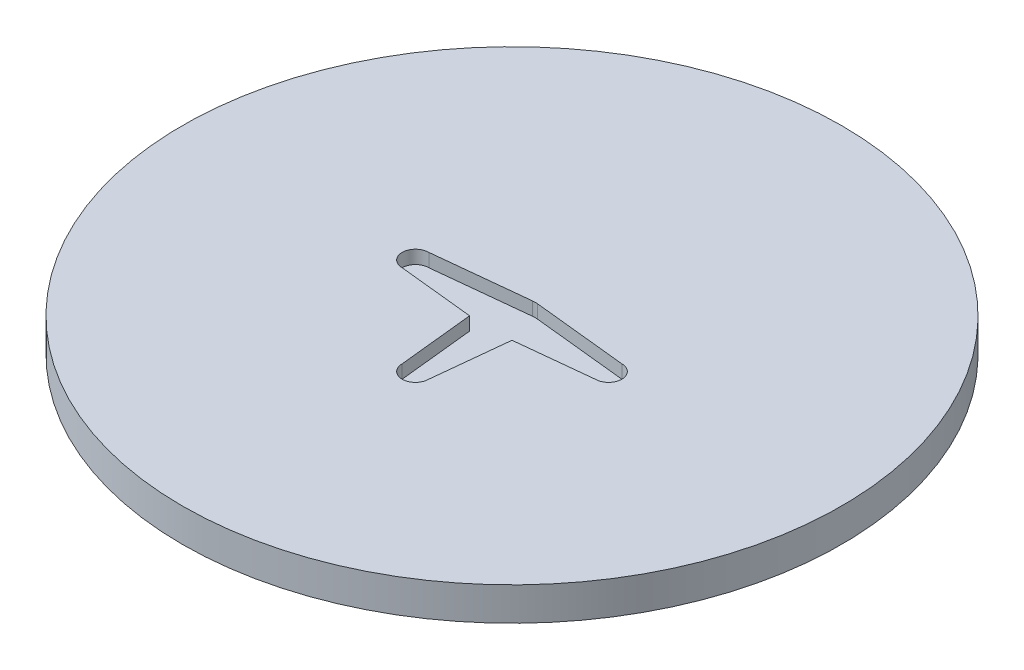
ISO-10303-21;
HEADER;
FILE_DESCRIPTION(('STEP AP214'),'2;1');
FILE_NAME('part.step','',(''),(''),'','','');
FILE_SCHEMA(('AUTOMOTIVE_DESIGN { 1 0 10303 214 1 1 1 1 }'));
ENDSEC;
DATA;
#1=APPLICATION_CONTEXT('core data for automotive mechanical design processes');
#2=APPLICATION_PROTOCOL_DEFINITION('international standard','automotive_design',2000,#1);
#3=PRODUCT_CONTEXT('',#1,'mechanical');
#4=PRODUCT('Part','Part','',(#3));
#5=PRODUCT_RELATED_PRODUCT_CATEGORY('part','',(#4));
#6=PRODUCT_DEFINITION_FORMATION('','',#4);
#7=PRODUCT_DEFINITION_CONTEXT('part definition',#1,'design');
#8=PRODUCT_DEFINITION('design','',#6,#7);
#9=PRODUCT_DEFINITION_SHAPE('','',#8);
#10=(LENGTH_UNIT() NAMED_UNIT(*) SI_UNIT(.MILLI.,.METRE.));
#11=(NAMED_UNIT(*) PLANE_ANGLE_UNIT() SI_UNIT($,.RADIAN.));
#12=(NAMED_UNIT(*) SI_UNIT($,.STERADIAN.) SOLID_ANGLE_UNIT());
#13=UNCERTAINTY_MEASURE_WITH_UNIT(LENGTH_MEASURE(1.E-05),#10,'distance_accuracy_value','');
#14=(GEOMETRIC_REPRESENTATION_CONTEXT(3) GLOBAL_UNCERTAINTY_ASSIGNED_CONTEXT((#13)) GLOBAL_UNIT_ASSIGNED_CONTEXT((#10,
#11,#12)) REPRESENTATION_CONTEXT('',''));
#15=CARTESIAN_POINT('',(0.,0.,0.));
#16=DIRECTION('',(0.,0.,1.));
#17=DIRECTION('',(1.,0.,0.));
#18=AXIS2_PLACEMENT_3D('',#15,#16,#17);
#19=CARTESIAN_POINT('',(0.,5.,0.));
#20=DIRECTION('',(0.,-1.,0.));
#21=DIRECTION('',(0.,0.,-1.));
#22=AXIS2_PLACEMENT_3D('',#19,#20,#21);
#23=CYLINDRICAL_SURFACE('',#22,49.5);
#24=CARTESIAN_POINT('',(0.,5.,0.));
#25=DIRECTION('',(0.,1.,0.));
#26=DIRECTION('',(0.,0.,1.));
#27=AXIS2_PLACEMENT_3D('',#24,#25,#26);
#28=CIRCLE('',#27,49.5);
#29=CARTESIAN_POINT('',(0.,5.,49.5));
#30=VERTEX_POINT('',#29);
#31=EDGE_CURVE('E224',#30,#30,#28,.T.);
#32=ORIENTED_EDGE('',*,*,#31,.F.);
#33=EDGE_LOOP('',(#32));
#34=FACE_BOUND('',#33,.T.);
#35=CARTESIAN_POINT('',(0.,0.,0.));
#36=DIRECTION('',(0.,1.,0.));
#37=DIRECTION('',(0.,0.,1.));
#38=AXIS2_PLACEMENT_3D('',#35,#36,#37);
#39=CIRCLE('',#38,49.5);
#40=CARTESIAN_POINT('',(0.,0.,49.5));
#41=VERTEX_POINT('',#40);
#42=EDGE_CURVE('E340',#41,#41,#39,.T.);
#43=ORIENTED_EDGE('',*,*,#42,.T.);
#44=EDGE_LOOP('',(#43));
#45=FACE_BOUND('',#44,.T.);
#46=ADVANCED_FACE('F41',(#34,#45),#23,.T.);
#47=CARTESIAN_POINT('',(0.,5.,0.));
#48=DIRECTION('',(0.,1.,0.));
#49=DIRECTION('',(0.,0.,1.));
#50=AXIS2_PLACEMENT_3D('',#47,#48,#49);
#51=PLANE('',#50);
#52=DIRECTION('',(0.104199109418575,0.,-0.994556456716448));
#53=VECTOR('',#52,1.);
#54=CARTESIAN_POINT('',(1.99999999999508,5.,14.4999999999985));
#55=LINE('',#54,#53);
#56=CARTESIAN_POINT('',(1.99999999999508,5.,14.4999999999985));
#57=VERTEX_POINT('',#56);
#58=CARTESIAN_POINT('',(3.18542186075908,5.,3.18542186075878));
#59=VERTEX_POINT('',#58);
#60=EDGE_CURVE('E414',#57,#59,#55,.T.);
#61=ORIENTED_EDGE('',*,*,#60,.F.);
#62=CARTESIAN_POINT('',(-4.92003613847647E-12,5.,14.4999999999982));
#63=DIRECTION('',(0.,1.,0.));
#64=DIRECTION('',(0.,0.,1.));
#65=AXIS2_PLACEMENT_3D('',#62,#63,#64);
#66=CIRCLE('',#65,2.);
#67=CARTESIAN_POINT('',(-2.00000000000492,5.,14.4999999998284));
#68=VERTEX_POINT('',#67);
#69=EDGE_CURVE('E377',#68,#57,#66,.T.);
#70=ORIENTED_EDGE('',*,*,#69,.F.);
#71=DIRECTION('',(0.104199109419498,0.,0.994556456716351));
#72=VECTOR('',#71,1.);
#73=CARTESIAN_POINT('',(-2.00000000000492,5.,14.4999999998284));
#74=LINE('',#73,#72);
#75=CARTESIAN_POINT('',(-3.18542186076191,5.,3.1854218607568));
#76=VERTEX_POINT('',#75);
#77=EDGE_CURVE('E382',#76,#68,#74,.T.);
#78=ORIENTED_EDGE('',*,*,#77,.F.);
#79=DIRECTION('',(0.994556456716432,0.,0.104199109418732));
#80=VECTOR('',#79,1.);
#81=CARTESIAN_POINT('',(-14.5000000000015,5.,1.99999999999101));
#82=LINE('',#81,#80);
#83=CARTESIAN_POINT('',(-14.5000000000009,5.,1.99999999999101));
#84=VERTEX_POINT('',#83);
#85=EDGE_CURVE('E386',#84,#76,#82,.T.);
#86=ORIENTED_EDGE('',*,*,#85,.F.);
#87=CARTESIAN_POINT('',(-14.5000000000009,5.,-8.98730331611076E-12));
#88=DIRECTION('',(0.,1.,0.));
#89=DIRECTION('',(0.,0.,1.));
#90=AXIS2_PLACEMENT_3D('',#87,#88,#89);
#91=CIRCLE('',#90,2.);
#92=CARTESIAN_POINT('',(-14.4999999998307,5.,-2.00000000000899));
#93=VERTEX_POINT('',#92);
#94=EDGE_CURVE('E390',#93,#84,#91,.T.);
#95=ORIENTED_EDGE('',*,*,#94,.F.);
#96=DIRECTION('',(-0.9945564567164,0.,0.104199109419028));
#97=VECTOR('',#96,1.);
#98=CARTESIAN_POINT('',(-14.4999999998307,5.,-2.00000000000899));
#99=LINE('',#98,#97);
#100=CARTESIAN_POINT('',(-0.364696882965874,5.,-3.48094759850748));
#101=VERTEX_POINT('',#100);
#102=EDGE_CURVE('E394',#101,#93,#99,.T.);
#103=ORIENTED_EDGE('',*,*,#102,.F.);
#104=CARTESIAN_POINT('',(0.,5.,0.));
#105=DIRECTION('',(0.,1.,0.));
#106=DIRECTION('',(0.,0.,1.));
#107=AXIS2_PLACEMENT_3D('',#104,#105,#106);
#108=CIRCLE('',#107,3.5);
#109=CARTESIAN_POINT('',(0.364696882964465,5.,-3.48094759850762));
#110=VERTEX_POINT('',#109);
#111=EDGE_CURVE('E398',#110,#101,#108,.T.);
#112=ORIENTED_EDGE('',*,*,#111,.F.);
#113=DIRECTION('',(-0.994556456716464,0.,-0.104199109418419));
#114=VECTOR('',#113,1.);
#115=CARTESIAN_POINT('',(14.5,5.,-2.));
#116=LINE('',#115,#114);
#117=CARTESIAN_POINT('',(14.5,5.,-2.));
#118=VERTEX_POINT('',#117);
#119=EDGE_CURVE('E402',#118,#110,#116,.T.);
#120=ORIENTED_EDGE('',*,*,#119,.F.);
#121=CARTESIAN_POINT('',(14.5,5.,0.));
#122=DIRECTION('',(0.,1.,0.));
#123=DIRECTION('',(0.,0.,1.));
#124=AXIS2_PLACEMENT_3D('',#121,#122,#123);
#125=CIRCLE('',#124,2.);
#126=CARTESIAN_POINT('',(14.4999999998305,5.,2.));
#127=VERTEX_POINT('',#126);
#128=EDGE_CURVE('E406',#127,#118,#125,.T.);
#129=ORIENTED_EDGE('',*,*,#128,.F.);
#130=DIRECTION('',(0.994556456716335,0.,-0.104199109419655));
#131=VECTOR('',#130,1.);
#132=CARTESIAN_POINT('',(14.4999999998305,5.,2.));
#133=LINE('',#132,#131);
#134=EDGE_CURVE('E410',#59,#127,#133,.T.);
#135=ORIENTED_EDGE('',*,*,#134,.F.);
#136=EDGE_LOOP('',(#61,#70,#78,#86,#95,#103,#112,#120,#129,#135));
#137=FACE_BOUND('',#136,.T.);
#138=ORIENTED_EDGE('',*,*,#31,.T.);
#139=EDGE_LOOP('',(#138));
#140=FACE_BOUND('',#139,.T.);
#141=ADVANCED_FACE('F322',(#137,#140),#51,.T.);
#142=CARTESIAN_POINT('',(0.,0.,0.));
#143=DIRECTION('',(0.,1.,0.));
#144=DIRECTION('',(0.,0.,1.));
#145=AXIS2_PLACEMENT_3D('',#142,#143,#144);
#146=PLANE('',#145);
#147=CARTESIAN_POINT('',(0.,0.,0.));
#148=DIRECTION('',(0.,-1.,0.));
#149=DIRECTION('',(-1.,0.,0.));
#150=AXIS2_PLACEMENT_3D('',#147,#148,#149);
#151=ELLIPSE('',#150,25.,7.5);
#152=CARTESIAN_POINT('',(7.18369713915863,0.,-7.18369713915866));
#153=VERTEX_POINT('',#152);
#154=CARTESIAN_POINT('',(7.18369713915864,0.,7.18369713915861));
#155=VERTEX_POINT('',#154);
#156=EDGE_CURVE('E474',#153,#155,#151,.T.);
#157=ORIENTED_EDGE('',*,*,#156,.F.);
#158=CARTESIAN_POINT('',(0.,0.,0.));
#159=DIRECTION('',(0.,-1.,0.));
#160=DIRECTION('',(0.,0.,-1.));
#161=AXIS2_PLACEMENT_3D('',#158,#159,#160);
#162=ELLIPSE('',#161,25.,7.5);
#163=CARTESIAN_POINT('',(-7.18369713915863,0.,-7.18369713915861));
#164=VERTEX_POINT('',#163);
#165=EDGE_CURVE('E477',#164,#153,#162,.T.);
#166=ORIENTED_EDGE('',*,*,#165,.F.);
#167=CARTESIAN_POINT('',(0.,0.,0.));
#168=DIRECTION('',(0.,-1.,0.));
#169=DIRECTION('',(-1.,0.,0.));
#170=AXIS2_PLACEMENT_3D('',#167,#168,#169);
#171=ELLIPSE('',#170,25.,7.5);
#172=CARTESIAN_POINT('',(-7.18369713915863,0.,7.18369713915865));
#173=VERTEX_POINT('',#172);
#174=EDGE_CURVE('E266',#173,#164,#171,.T.);
#175=ORIENTED_EDGE('',*,*,#174,.F.);
#176=CARTESIAN_POINT('',(0.,0.,0.));
#177=DIRECTION('',(0.,-1.,0.));
#178=DIRECTION('',(0.,0.,-1.));
#179=AXIS2_PLACEMENT_3D('',#176,#177,#178);
#180=ELLIPSE('',#179,25.,7.5);
#181=EDGE_CURVE('E470',#155,#173,#180,.T.);
#182=ORIENTED_EDGE('',*,*,#181,.F.);
#183=EDGE_LOOP('',(#157,#166,#175,#182));
#184=FACE_BOUND('',#183,.T.);
#185=ORIENTED_EDGE('',*,*,#42,.F.);
#186=EDGE_LOOP('',(#185));
#187=FACE_BOUND('',#186,.T.);
#188=ADVANCED_FACE('F320',(#184,#187),#146,.F.);
#189=CARTESIAN_POINT('',(1.99999999999508,3.,14.4999999999985));
#190=DIRECTION('',(0.994556456716448,0.,0.104199109418575));
#191=DIRECTION('',(0.104199109418575,0.,-0.994556456716448));
#192=AXIS2_PLACEMENT_3D('',#189,#190,#191);
#193=PLANE('',#192);
#194=ORIENTED_EDGE('',*,*,#60,.T.);
#195=DIRECTION('',(0.,1.,0.));
#196=VECTOR('',#195,1.);
#197=CARTESIAN_POINT('',(3.18542186075908,3.,3.18542186075878));
#198=LINE('',#197,#196);
#199=CARTESIAN_POINT('',(3.18542186075908,3.,3.18542186075878));
#200=VERTEX_POINT('',#199);
#201=EDGE_CURVE('E349',#200,#59,#198,.T.);
#202=ORIENTED_EDGE('',*,*,#201,.F.);
#203=DIRECTION('',(0.104199109418575,0.,-0.994556456716448));
#204=VECTOR('',#203,1.);
#205=CARTESIAN_POINT('',(1.99999999999508,3.,14.4999999999985));
#206=LINE('',#205,#204);
#207=CARTESIAN_POINT('',(1.99999999999508,3.,14.4999999999985));
#208=VERTEX_POINT('',#207);
#209=EDGE_CURVE('E381',#208,#200,#206,.T.);
#210=ORIENTED_EDGE('',*,*,#209,.F.);
#211=DIRECTION('',(0.,1.,0.));
#212=VECTOR('',#211,1.);
#213=CARTESIAN_POINT('',(1.99999999999508,3.,14.4999999999985));
#214=LINE('',#213,#212);
#215=EDGE_CURVE('E342',#208,#57,#214,.T.);
#216=ORIENTED_EDGE('',*,*,#215,.T.);
#217=EDGE_LOOP('',(#194,#202,#210,#216));
#218=FACE_BOUND('',#217,.T.);
#219=ADVANCED_FACE('F286',(#218),#193,.F.);
#220=CARTESIAN_POINT('',(-4.92003613847647E-12,3.,14.4999999999982));
#221=DIRECTION('',(0.,1.,0.));
#222=DIRECTION('',(0.,0.,1.));
#223=AXIS2_PLACEMENT_3D('',#220,#221,#222);
#224=CYLINDRICAL_SURFACE('',#223,2.);
#225=ORIENTED_EDGE('',*,*,#69,.T.);
#226=ORIENTED_EDGE('',*,*,#215,.F.);
#227=CARTESIAN_POINT('',(-4.92003613847647E-12,3.,14.4999999999982));
#228=DIRECTION('',(0.,1.,0.));
#229=DIRECTION('',(0.,0.,1.));
#230=AXIS2_PLACEMENT_3D('',#227,#228,#229);
#231=CIRCLE('',#230,2.);
#232=CARTESIAN_POINT('',(-2.00000000000492,3.,14.4999999998284));
#233=VERTEX_POINT('',#232);
#234=EDGE_CURVE('E354',#233,#208,#231,.T.);
#235=ORIENTED_EDGE('',*,*,#234,.F.);
#236=DIRECTION('',(0.,1.,0.));
#237=VECTOR('',#236,1.);
#238=CARTESIAN_POINT('',(-2.00000000000492,3.,14.4999999998284));
#239=LINE('',#238,#237);
#240=EDGE_CURVE('E346',#233,#68,#239,.T.);
#241=ORIENTED_EDGE('',*,*,#240,.T.);
#242=EDGE_LOOP('',(#225,#226,#235,#241));
#243=FACE_BOUND('',#242,.T.);
#244=ADVANCED_FACE('F282',(#243),#224,.F.);
#245=CARTESIAN_POINT('',(-2.00000000000492,3.,14.4999999998284));
#246=DIRECTION('',(-0.994556456716351,0.,0.104199109419498));
#247=DIRECTION('',(0.104199109419498,0.,0.994556456716351));
#248=AXIS2_PLACEMENT_3D('',#245,#246,#247);
#249=PLANE('',#248);
#250=ORIENTED_EDGE('',*,*,#77,.T.);
#251=ORIENTED_EDGE('',*,*,#240,.F.);
#252=DIRECTION('',(0.104199109419498,0.,0.994556456716351));
#253=VECTOR('',#252,1.);
#254=CARTESIAN_POINT('',(-2.00000000000492,3.,14.4999999998284));
#255=LINE('',#254,#253);
#256=CARTESIAN_POINT('',(-3.18542186076191,3.,3.1854218607568));
#257=VERTEX_POINT('',#256);
#258=EDGE_CURVE('E421',#257,#233,#255,.T.);
#259=ORIENTED_EDGE('',*,*,#258,.F.);
#260=DIRECTION('',(0.,1.,0.));
#261=VECTOR('',#260,1.);
#262=CARTESIAN_POINT('',(-3.18542186076191,3.,3.1854218607568));
#263=LINE('',#262,#261);
#264=EDGE_CURVE('E372',#257,#76,#263,.T.);
#265=ORIENTED_EDGE('',*,*,#264,.T.);
#266=EDGE_LOOP('',(#250,#251,#259,#265));
#267=FACE_BOUND('',#266,.T.);
#268=ADVANCED_FACE('F285',(#267),#249,.F.);
#269=CARTESIAN_POINT('',(-14.5000000000015,3.,1.99999999999101));
#270=DIRECTION('',(-0.104199109418732,0.,0.994556456716432));
#271=DIRECTION('',(0.994556456716432,0.,0.104199109418732));
#272=AXIS2_PLACEMENT_3D('',#269,#270,#271);
#273=PLANE('',#272);
#274=ORIENTED_EDGE('',*,*,#85,.T.);
#275=ORIENTED_EDGE('',*,*,#264,.F.);
#276=DIRECTION('',(0.994556456716432,0.,0.104199109418732));
#277=VECTOR('',#276,1.);
#278=CARTESIAN_POINT('',(-14.5000000000015,3.,1.99999999999101));
#279=LINE('',#278,#277);
#280=CARTESIAN_POINT('',(-14.5000000000009,3.,1.99999999999101));
#281=VERTEX_POINT('',#280);
#282=EDGE_CURVE('E425',#281,#257,#279,.T.);
#283=ORIENTED_EDGE('',*,*,#282,.F.);
#284=DIRECTION('',(0.,1.,0.));
#285=VECTOR('',#284,1.);
#286=CARTESIAN_POINT('',(-14.5000000000009,3.,1.99999999999101));
#287=LINE('',#286,#285);
#288=EDGE_CURVE('E369',#281,#84,#287,.T.);
#289=ORIENTED_EDGE('',*,*,#288,.T.);
#290=EDGE_LOOP('',(#274,#275,#283,#289));
#291=FACE_BOUND('',#290,.T.);
#292=ADVANCED_FACE('F290',(#291),#273,.F.);
#293=CARTESIAN_POINT('',(-14.5000000000009,3.,-8.98730331611076E-12));
#294=DIRECTION('',(0.,1.,0.));
#295=DIRECTION('',(0.,0.,1.));
#296=AXIS2_PLACEMENT_3D('',#293,#294,#295);
#297=CYLINDRICAL_SURFACE('',#296,2.);
#298=ORIENTED_EDGE('',*,*,#94,.T.);
#299=ORIENTED_EDGE('',*,*,#288,.F.);
#300=CARTESIAN_POINT('',(-14.5000000000009,3.,-8.98730331611076E-12));
#301=DIRECTION('',(0.,1.,0.));
#302=DIRECTION('',(0.,0.,1.));
#303=AXIS2_PLACEMENT_3D('',#300,#301,#302);
#304=CIRCLE('',#303,2.);
#305=CARTESIAN_POINT('',(-14.4999999998307,3.,-2.00000000000899));
#306=VERTEX_POINT('',#305);
#307=EDGE_CURVE('E429',#306,#281,#304,.T.);
#308=ORIENTED_EDGE('',*,*,#307,.F.);
#309=DIRECTION('',(0.,1.,0.));
#310=VECTOR('',#309,1.);
#311=CARTESIAN_POINT('',(-14.4999999998307,3.,-2.00000000000899));
#312=LINE('',#311,#310);
#313=EDGE_CURVE('E366',#306,#93,#312,.T.);
#314=ORIENTED_EDGE('',*,*,#313,.T.);
#315=EDGE_LOOP('',(#298,#299,#308,#314));
#316=FACE_BOUND('',#315,.T.);
#317=ADVANCED_FACE('F294',(#316),#297,.F.);
#318=CARTESIAN_POINT('',(-14.4999999998307,3.,-2.00000000000899));
#319=DIRECTION('',(-0.104199109419028,0.,-0.994556456716401));
#320=DIRECTION('',(-0.994556456716401,0.,0.104199109419028));
#321=AXIS2_PLACEMENT_3D('',#318,#319,#320);
#322=PLANE('',#321);
#323=ORIENTED_EDGE('',*,*,#102,.T.);
#324=ORIENTED_EDGE('',*,*,#313,.F.);
#325=DIRECTION('',(-0.9945564567164,0.,0.104199109419028));
#326=VECTOR('',#325,1.);
#327=CARTESIAN_POINT('',(-14.4999999998307,3.,-2.00000000000899));
#328=LINE('',#327,#326);
#329=CARTESIAN_POINT('',(-0.364696882965874,3.,-3.48094759850748));
#330=VERTEX_POINT('',#329);
#331=EDGE_CURVE('E433',#330,#306,#328,.T.);
#332=ORIENTED_EDGE('',*,*,#331,.F.);
#333=DIRECTION('',(0.,1.,0.));
#334=VECTOR('',#333,1.);
#335=CARTESIAN_POINT('',(-0.364696882965874,3.,-3.48094759850748));
#336=LINE('',#335,#334);
#337=EDGE_CURVE('E363',#330,#101,#336,.T.);
#338=ORIENTED_EDGE('',*,*,#337,.T.);
#339=EDGE_LOOP('',(#323,#324,#332,#338));
#340=FACE_BOUND('',#339,.T.);
#341=ADVANCED_FACE('F298',(#340),#322,.F.);
#342=CARTESIAN_POINT('',(0.,3.,0.));
#343=DIRECTION('',(0.,1.,0.));
#344=DIRECTION('',(0.,0.,1.));
#345=AXIS2_PLACEMENT_3D('',#342,#343,#344);
#346=CYLINDRICAL_SURFACE('',#345,3.5);
#347=ORIENTED_EDGE('',*,*,#111,.T.);
#348=ORIENTED_EDGE('',*,*,#337,.F.);
#349=CARTESIAN_POINT('',(0.,3.,0.));
#350=DIRECTION('',(0.,1.,0.));
#351=DIRECTION('',(0.,0.,1.));
#352=AXIS2_PLACEMENT_3D('',#349,#350,#351);
#353=CIRCLE('',#352,3.5);
#354=CARTESIAN_POINT('',(0.364696882964465,3.,-3.48094759850762));
#355=VERTEX_POINT('',#354);
#356=EDGE_CURVE('E437',#355,#330,#353,.T.);
#357=ORIENTED_EDGE('',*,*,#356,.F.);
#358=DIRECTION('',(0.,1.,0.));
#359=VECTOR('',#358,1.);
#360=CARTESIAN_POINT('',(0.364696882964465,3.,-3.48094759850762));
#361=LINE('',#360,#359);
#362=EDGE_CURVE('E360',#355,#110,#361,.T.);
#363=ORIENTED_EDGE('',*,*,#362,.T.);
#364=EDGE_LOOP('',(#347,#348,#357,#363));
#365=FACE_BOUND('',#364,.T.);
#366=ADVANCED_FACE('F302',(#365),#346,.F.);
#367=CARTESIAN_POINT('',(14.5,3.,-2.));
#368=DIRECTION('',(0.104199109418419,0.,-0.994556456716465));
#369=DIRECTION('',(-0.994556456716464,0.,-0.104199109418419));
#370=AXIS2_PLACEMENT_3D('',#367,#368,#369);
#371=PLANE('',#370);
#372=ORIENTED_EDGE('',*,*,#119,.T.);
#373=ORIENTED_EDGE('',*,*,#362,.F.);
#374=DIRECTION('',(-0.994556456716464,0.,-0.104199109418419));
#375=VECTOR('',#374,1.);
#376=CARTESIAN_POINT('',(14.5,3.,-2.));
#377=LINE('',#376,#375);
#378=CARTESIAN_POINT('',(14.5,3.,-2.));
#379=VERTEX_POINT('',#378);
#380=EDGE_CURVE('E441',#379,#355,#377,.T.);
#381=ORIENTED_EDGE('',*,*,#380,.F.);
#382=DIRECTION('',(0.,1.,0.));
#383=VECTOR('',#382,1.);
#384=CARTESIAN_POINT('',(14.5,3.,-2.));
#385=LINE('',#384,#383);
#386=EDGE_CURVE('E357',#379,#118,#385,.T.);
#387=ORIENTED_EDGE('',*,*,#386,.T.);
#388=EDGE_LOOP('',(#372,#373,#381,#387));
#389=FACE_BOUND('',#388,.T.);
#390=ADVANCED_FACE('F306',(#389),#371,.F.);
#391=CARTESIAN_POINT('',(14.5,3.,0.));
#392=DIRECTION('',(0.,1.,0.));
#393=DIRECTION('',(0.,0.,1.));
#394=AXIS2_PLACEMENT_3D('',#391,#392,#393);
#395=CYLINDRICAL_SURFACE('',#394,2.);
#396=ORIENTED_EDGE('',*,*,#128,.T.);
#397=ORIENTED_EDGE('',*,*,#386,.F.);
#398=CARTESIAN_POINT('',(14.5,3.,0.));
#399=DIRECTION('',(0.,1.,0.));
#400=DIRECTION('',(0.,0.,1.));
#401=AXIS2_PLACEMENT_3D('',#398,#399,#400);
#402=CIRCLE('',#401,2.);
#403=CARTESIAN_POINT('',(14.4999999998305,3.,2.));
#404=VERTEX_POINT('',#403);
#405=EDGE_CURVE('E445',#404,#379,#402,.T.);
#406=ORIENTED_EDGE('',*,*,#405,.F.);
#407=DIRECTION('',(0.,1.,0.));
#408=VECTOR('',#407,1.);
#409=CARTESIAN_POINT('',(14.4999999998305,3.,2.));
#410=LINE('',#409,#408);
#411=EDGE_CURVE('E353',#404,#127,#410,.T.);
#412=ORIENTED_EDGE('',*,*,#411,.T.);
#413=EDGE_LOOP('',(#396,#397,#406,#412));
#414=FACE_BOUND('',#413,.T.);
#415=ADVANCED_FACE('F310',(#414),#395,.F.);
#416=CARTESIAN_POINT('',(14.4999999998305,3.,2.));
#417=DIRECTION('',(0.104199109419655,0.,0.994556456716335));
#418=DIRECTION('',(0.994556456716335,0.,-0.104199109419655));
#419=AXIS2_PLACEMENT_3D('',#416,#417,#418);
#420=PLANE('',#419);
#421=ORIENTED_EDGE('',*,*,#134,.T.);
#422=ORIENTED_EDGE('',*,*,#411,.F.);
#423=DIRECTION('',(0.994556456716335,0.,-0.104199109419655));
#424=VECTOR('',#423,1.);
#425=CARTESIAN_POINT('',(14.4999999998305,3.,2.));
#426=LINE('',#425,#424);
#427=EDGE_CURVE('E449',#200,#404,#426,.T.);
#428=ORIENTED_EDGE('',*,*,#427,.F.);
#429=ORIENTED_EDGE('',*,*,#201,.T.);
#430=EDGE_LOOP('',(#421,#422,#428,#429));
#431=FACE_BOUND('',#430,.T.);
#432=ADVANCED_FACE('F280',(#431),#420,.F.);
#433=CARTESIAN_POINT('',(14.5,3.,0.));
#434=DIRECTION('',(0.,1.,0.));
#435=DIRECTION('',(0.,0.,1.));
#436=AXIS2_PLACEMENT_3D('',#433,#434,#435);
#437=PLANE('',#436);
#438=ORIENTED_EDGE('',*,*,#209,.T.);
#439=ORIENTED_EDGE('',*,*,#427,.T.);
#440=ORIENTED_EDGE('',*,*,#405,.T.);
#441=ORIENTED_EDGE('',*,*,#380,.T.);
#442=ORIENTED_EDGE('',*,*,#356,.T.);
#443=ORIENTED_EDGE('',*,*,#331,.T.);
#444=ORIENTED_EDGE('',*,*,#307,.T.);
#445=ORIENTED_EDGE('',*,*,#282,.T.);
#446=ORIENTED_EDGE('',*,*,#258,.T.);
#447=ORIENTED_EDGE('',*,*,#234,.T.);
#448=EDGE_LOOP('',(#438,#439,#440,#441,#442,#443,#444,#445,#446,#447));
#449=FACE_BOUND('',#448,.T.);
#450=ADVANCED_FACE('F275',(#449),#437,.T.);
#451=CARTESIAN_POINT('',(0.,2.5,0.));
#452=DIRECTION('',(0.,-1.,0.));
#453=DIRECTION('',(0.,0.,-1.));
#454=AXIS2_PLACEMENT_3D('',#451,#452,#453);
#455=ELLIPSE('',#454,25.,7.5);
#456=DIRECTION('',(0.,-1.,0.));
#457=VECTOR('',#456,1.);
#458=SURFACE_OF_LINEAR_EXTRUSION('',#455,#457);
#459=CARTESIAN_POINT('',(0.,1.,0.));
#460=DIRECTION('',(0.,-1.,0.));
#461=DIRECTION('',(0.,0.,-1.));
#462=AXIS2_PLACEMENT_3D('',#459,#460,#461);
#463=ELLIPSE('',#462,25.,7.5);
#464=CARTESIAN_POINT('',(7.18369713915863,1.,-7.18369713915866));
#465=VERTEX_POINT('',#464);
#466=CARTESIAN_POINT('',(0.,1.,-25.));
#467=VERTEX_POINT('',#466);
#468=EDGE_CURVE('E221',#465,#467,#463,.F.);
#469=ORIENTED_EDGE('',*,*,#468,.T.);
#470=DIRECTION('',(0.,1.,0.));
#471=VECTOR('',#470,1.);
#472=CARTESIAN_POINT('',(0.,1.,-25.));
#473=LINE('',#472,#471);
#474=CARTESIAN_POINT('',(0.,2.5,-25.));
#475=VERTEX_POINT('',#474);
#476=EDGE_CURVE('E812',#467,#475,#473,.T.);
#477=ORIENTED_EDGE('',*,*,#476,.T.);
#478=CARTESIAN_POINT('',(-6.07420192267783,2.5,-14.6644206623215));
#479=VERTEX_POINT('',#478);
#480=EDGE_CURVE('E261',#479,#475,#455,.T.);
#481=ORIENTED_EDGE('',*,*,#480,.F.);
#482=DIRECTION('',(0.,1.,0.));
#483=VECTOR('',#482,1.);
#484=CARTESIAN_POINT('',(-6.07420192267783,1.,-14.6644206623215));
#485=LINE('',#484,#483);
#486=CARTESIAN_POINT('',(-6.07420192267783,1.,-14.6644206623215));
#487=VERTEX_POINT('',#486);
#488=EDGE_CURVE('E807',#487,#479,#485,.T.);
#489=ORIENTED_EDGE('',*,*,#488,.F.);
#490=CARTESIAN_POINT('',(-7.18369713915863,1.,-7.18369713915861));
#491=VERTEX_POINT('',#490);
#492=EDGE_CURVE('E247',#487,#491,#463,.F.);
#493=ORIENTED_EDGE('',*,*,#492,.T.);
#494=DIRECTION('',(0.,-1.,0.));
#495=VECTOR('',#494,1.);
#496=CARTESIAN_POINT('',(-7.18369713915863,2.5,-7.18369713915861));
#497=LINE('',#496,#495);
#498=EDGE_CURVE('E417',#491,#164,#497,.T.);
#499=ORIENTED_EDGE('',*,*,#498,.T.);
#500=ORIENTED_EDGE('',*,*,#165,.T.);
#501=DIRECTION('',(0.,-1.,0.));
#502=VECTOR('',#501,1.);
#503=CARTESIAN_POINT('',(7.18369713915863,2.5,-7.18369713915866));
#504=LINE('',#503,#502);
#505=EDGE_CURVE('E64',#465,#153,#504,.T.);
#506=ORIENTED_EDGE('',*,*,#505,.F.);
#507=EDGE_LOOP('',(#469,#477,#481,#489,#493,#499,#500,#506));
#508=FACE_BOUND('',#507,.T.);
#509=ADVANCED_FACE('F270',(#508),#458,.F.);
#510=CARTESIAN_POINT('',(0.,2.5,0.));
#511=DIRECTION('',(0.,-1.,0.));
#512=DIRECTION('',(-1.,0.,0.));
#513=AXIS2_PLACEMENT_3D('',#510,#511,#512);
#514=ELLIPSE('',#513,25.,7.5);
#515=DIRECTION('',(0.,-1.,0.));
#516=VECTOR('',#515,1.);
#517=SURFACE_OF_LINEAR_EXTRUSION('',#514,#516);
#518=CARTESIAN_POINT('',(0.,1.,0.));
#519=DIRECTION('',(0.,-1.,0.));
#520=DIRECTION('',(-1.,0.,0.));
#521=AXIS2_PLACEMENT_3D('',#518,#519,#520);
#522=ELLIPSE('',#521,25.,7.5);
#523=CARTESIAN_POINT('',(-25.,1.,0.));
#524=VERTEX_POINT('',#523);
#525=EDGE_CURVE('E260',#491,#524,#522,.F.);
#526=ORIENTED_EDGE('',*,*,#525,.T.);
#527=DIRECTION('',(0.,1.,0.));
#528=VECTOR('',#527,1.);
#529=CARTESIAN_POINT('',(-25.,1.,0.));
#530=LINE('',#529,#528);
#531=CARTESIAN_POINT('',(-25.,2.5,0.));
#532=VERTEX_POINT('',#531);
#533=EDGE_CURVE('E824',#524,#532,#530,.T.);
#534=ORIENTED_EDGE('',*,*,#533,.T.);
#535=CARTESIAN_POINT('',(-14.6644206623215,2.5,6.07420192267788));
#536=VERTEX_POINT('',#535);
#537=EDGE_CURVE('E459',#536,#532,#514,.T.);
#538=ORIENTED_EDGE('',*,*,#537,.F.);
#539=DIRECTION('',(0.,1.,0.));
#540=VECTOR('',#539,1.);
#541=CARTESIAN_POINT('',(-14.6644206623215,1.,6.07420192267788));
#542=LINE('',#541,#540);
#543=CARTESIAN_POINT('',(-14.6644206623215,1.,6.07420192267788));
#544=VERTEX_POINT('',#543);
#545=EDGE_CURVE('E508',#544,#536,#542,.T.);
#546=ORIENTED_EDGE('',*,*,#545,.F.);
#547=CARTESIAN_POINT('',(-7.18369713915863,1.,7.18369713915865));
#548=VERTEX_POINT('',#547);
#549=EDGE_CURVE('E256',#544,#548,#522,.F.);
#550=ORIENTED_EDGE('',*,*,#549,.T.);
#551=DIRECTION('',(0.,-1.,0.));
#552=VECTOR('',#551,1.);
#553=CARTESIAN_POINT('',(-7.18369713915863,2.5,7.18369713915865));
#554=LINE('',#553,#552);
#555=EDGE_CURVE('E462',#548,#173,#554,.T.);
#556=ORIENTED_EDGE('',*,*,#555,.T.);
#557=ORIENTED_EDGE('',*,*,#174,.T.);
#558=ORIENTED_EDGE('',*,*,#498,.F.);
#559=EDGE_LOOP('',(#526,#534,#538,#546,#550,#556,#557,#558));
#560=FACE_BOUND('',#559,.T.);
#561=ADVANCED_FACE('F274',(#560),#517,.F.);
#562=CARTESIAN_POINT('',(0.,2.5,0.));
#563=DIRECTION('',(0.,-1.,0.));
#564=DIRECTION('',(0.,0.,-1.));
#565=AXIS2_PLACEMENT_3D('',#562,#563,#564);
#566=ELLIPSE('',#565,25.,7.5);
#567=DIRECTION('',(0.,-1.,0.));
#568=VECTOR('',#567,1.);
#569=SURFACE_OF_LINEAR_EXTRUSION('',#566,#568);
#570=ORIENTED_EDGE('',*,*,#555,.F.);
#571=CARTESIAN_POINT('',(0.,1.,0.));
#572=DIRECTION('',(0.,-1.,0.));
#573=DIRECTION('',(0.,0.,-1.));
#574=AXIS2_PLACEMENT_3D('',#571,#572,#573);
#575=ELLIPSE('',#574,25.,7.5);
#576=CARTESIAN_POINT('',(0.,1.,25.));
#577=VERTEX_POINT('',#576);
#578=EDGE_CURVE('E255',#548,#577,#575,.F.);
#579=ORIENTED_EDGE('',*,*,#578,.T.);
#580=DIRECTION('',(0.,1.,0.));
#581=VECTOR('',#580,1.);
#582=CARTESIAN_POINT('',(0.,1.,25.));
#583=LINE('',#582,#581);
#584=CARTESIAN_POINT('',(0.,2.5,25.));
#585=VERTEX_POINT('',#584);
#586=EDGE_CURVE('E832',#577,#585,#583,.T.);
#587=ORIENTED_EDGE('',*,*,#586,.T.);
#588=CARTESIAN_POINT('',(6.07420192267783,2.5,14.6644206623215));
#589=VERTEX_POINT('',#588);
#590=EDGE_CURVE('E483',#589,#585,#566,.T.);
#591=ORIENTED_EDGE('',*,*,#590,.F.);
#592=DIRECTION('',(0.,1.,0.));
#593=VECTOR('',#592,1.);
#594=CARTESIAN_POINT('',(6.07420192267783,1.,14.6644206623215));
#595=LINE('',#594,#593);
#596=CARTESIAN_POINT('',(6.07420192267783,1.,14.6644206623215));
#597=VERTEX_POINT('',#596);
#598=EDGE_CURVE('E835',#597,#589,#595,.T.);
#599=ORIENTED_EDGE('',*,*,#598,.F.);
#600=CARTESIAN_POINT('',(7.18369713915864,1.,7.18369713915861));
#601=VERTEX_POINT('',#600);
#602=EDGE_CURVE('E245',#597,#601,#575,.F.);
#603=ORIENTED_EDGE('',*,*,#602,.T.);
#604=DIRECTION('',(0.,-1.,0.));
#605=VECTOR('',#604,1.);
#606=CARTESIAN_POINT('',(7.18369713915864,2.5,7.18369713915861));
#607=LINE('',#606,#605);
#608=EDGE_CURVE('E458',#601,#155,#607,.T.);
#609=ORIENTED_EDGE('',*,*,#608,.T.);
#610=ORIENTED_EDGE('',*,*,#181,.T.);
#611=EDGE_LOOP('',(#570,#579,#587,#591,#599,#603,#609,#610));
#612=FACE_BOUND('',#611,.T.);
#613=ADVANCED_FACE('F488',(#612),#569,.F.);
#614=CARTESIAN_POINT('',(0.,2.5,0.));
#615=DIRECTION('',(0.,-1.,0.));
#616=DIRECTION('',(-1.,0.,0.));
#617=AXIS2_PLACEMENT_3D('',#614,#615,#616);
#618=ELLIPSE('',#617,25.,7.5);
#619=DIRECTION('',(0.,-1.,0.));
#620=VECTOR('',#619,1.);
#621=SURFACE_OF_LINEAR_EXTRUSION('',#618,#620);
#622=ORIENTED_EDGE('',*,*,#608,.F.);
#623=CARTESIAN_POINT('',(0.,1.,0.));
#624=DIRECTION('',(0.,-1.,0.));
#625=DIRECTION('',(-1.,0.,0.));
#626=AXIS2_PLACEMENT_3D('',#623,#624,#625);
#627=ELLIPSE('',#626,25.,7.5);
#628=CARTESIAN_POINT('',(25.,1.,0.));
#629=VERTEX_POINT('',#628);
#630=EDGE_CURVE('E11',#601,#629,#627,.F.);
#631=ORIENTED_EDGE('',*,*,#630,.T.);
#632=DIRECTION('',(0.,1.,0.));
#633=VECTOR('',#632,1.);
#634=CARTESIAN_POINT('',(25.,1.,0.));
#635=LINE('',#634,#633);
#636=CARTESIAN_POINT('',(25.,2.5,0.));
#637=VERTEX_POINT('',#636);
#638=EDGE_CURVE('E241',#629,#637,#635,.T.);
#639=ORIENTED_EDGE('',*,*,#638,.T.);
#640=CARTESIAN_POINT('',(14.6644206623215,2.5,-6.07420192267788));
#641=VERTEX_POINT('',#640);
#642=EDGE_CURVE('E239',#641,#637,#618,.T.);
#643=ORIENTED_EDGE('',*,*,#642,.F.);
#644=DIRECTION('',(0.,1.,0.));
#645=VECTOR('',#644,1.);
#646=CARTESIAN_POINT('',(14.6644206623215,1.,-6.07420192267788));
#647=LINE('',#646,#645);
#648=CARTESIAN_POINT('',(14.6644206623215,1.,-6.07420192267788));
#649=VERTEX_POINT('',#648);
#650=EDGE_CURVE('E228',#649,#641,#647,.T.);
#651=ORIENTED_EDGE('',*,*,#650,.F.);
#652=EDGE_CURVE('E44',#649,#465,#627,.F.);
#653=ORIENTED_EDGE('',*,*,#652,.T.);
#654=ORIENTED_EDGE('',*,*,#505,.T.);
#655=ORIENTED_EDGE('',*,*,#156,.T.);
#656=EDGE_LOOP('',(#622,#631,#639,#643,#651,#653,#654,#655));
#657=FACE_BOUND('',#656,.T.);
#658=ADVANCED_FACE('F237',(#657),#621,.F.);
#659=CARTESIAN_POINT('',(0.,2.5,0.));
#660=DIRECTION('',(0.,-1.,0.));
#661=DIRECTION('',(0.,0.,-1.));
#662=AXIS2_PLACEMENT_3D('',#659,#660,#661);
#663=PLANE('',#662);
#664=CARTESIAN_POINT('',(0.,2.5,0.));
#665=DIRECTION('',(0.,-1.,0.));
#666=DIRECTION('',(0.,0.,-1.));
#667=AXIS2_PLACEMENT_3D('',#664,#665,#666);
#668=CIRCLE('',#667,2.5);
#669=CARTESIAN_POINT('',(0.,2.5,-2.5));
#670=VERTEX_POINT('',#669);
#671=EDGE_CURVE('E788',#670,#670,#668,.T.);
#672=ORIENTED_EDGE('',*,*,#671,.F.);
#673=EDGE_LOOP('',(#672));
#674=FACE_BOUND('',#673,.T.);
#675=CARTESIAN_POINT('',(0.,2.5,0.));
#676=DIRECTION('',(0.,-1.,0.));
#677=DIRECTION('',(-0.707106781186549,0.,-0.707106781186546));
#678=AXIS2_PLACEMENT_3D('',#675,#676,#677);
#679=ELLIPSE('',#678,25.,7.5);
#680=CARTESIAN_POINT('',(-17.6776695296637,2.5,-17.6776695296637));
#681=VERTEX_POINT('',#680);
#682=EDGE_CURVE('E797',#681,#479,#679,.T.);
#683=ORIENTED_EDGE('',*,*,#682,.T.);
#684=ORIENTED_EDGE('',*,*,#480,.T.);
#685=CARTESIAN_POINT('',(0.,2.5,0.));
#686=DIRECTION('',(0.,-1.,0.));
#687=DIRECTION('',(0.,0.,-1.));
#688=AXIS2_PLACEMENT_3D('',#685,#686,#687);
#689=CIRCLE('',#688,25.);
#690=CARTESIAN_POINT('',(17.6776695296636,2.5,-17.6776695296638));
#691=VERTEX_POINT('',#690);
#692=EDGE_CURVE('E234',#475,#691,#689,.T.);
#693=ORIENTED_EDGE('',*,*,#692,.T.);
#694=CARTESIAN_POINT('',(0.,2.5,0.));
#695=DIRECTION('',(0.,-1.,0.));
#696=DIRECTION('',(-0.707106781186544,0.,0.707106781186551));
#697=AXIS2_PLACEMENT_3D('',#694,#695,#696);
#698=ELLIPSE('',#697,25.,7.5);
#699=EDGE_CURVE('E56',#691,#641,#698,.T.);
#700=ORIENTED_EDGE('',*,*,#699,.T.);
#701=ORIENTED_EDGE('',*,*,#642,.T.);
#702=CARTESIAN_POINT('',(0.,2.5,0.));
#703=DIRECTION('',(0.,-1.,0.));
#704=DIRECTION('',(0.,0.,-1.));
#705=AXIS2_PLACEMENT_3D('',#702,#703,#704);
#706=CIRCLE('',#705,25.);
#707=CARTESIAN_POINT('',(17.6776695296637,2.5,17.6776695296637));
#708=VERTEX_POINT('',#707);
#709=EDGE_CURVE('E791',#637,#708,#706,.T.);
#710=ORIENTED_EDGE('',*,*,#709,.T.);
#711=CARTESIAN_POINT('',(0.,2.5,0.));
#712=DIRECTION('',(0.,-1.,0.));
#713=DIRECTION('',(-0.707106781186549,0.,-0.707106781186546));
#714=AXIS2_PLACEMENT_3D('',#711,#712,#713);
#715=ELLIPSE('',#714,25.,7.5);
#716=EDGE_CURVE('E843',#708,#589,#715,.T.);
#717=ORIENTED_EDGE('',*,*,#716,.T.);
#718=ORIENTED_EDGE('',*,*,#590,.T.);
#719=CARTESIAN_POINT('',(0.,2.5,0.));
#720=DIRECTION('',(0.,-1.,0.));
#721=DIRECTION('',(0.,0.,-1.));
#722=AXIS2_PLACEMENT_3D('',#719,#720,#721);
#723=CIRCLE('',#722,25.);
#724=CARTESIAN_POINT('',(-17.6776695296636,2.5,17.6776695296638));
#725=VERTEX_POINT('',#724);
#726=EDGE_CURVE('E848',#585,#725,#723,.T.);
#727=ORIENTED_EDGE('',*,*,#726,.T.);
#728=CARTESIAN_POINT('',(0.,2.5,0.));
#729=DIRECTION('',(0.,-1.,0.));
#730=DIRECTION('',(-0.707106781186544,0.,0.707106781186551));
#731=AXIS2_PLACEMENT_3D('',#728,#729,#730);
#732=ELLIPSE('',#731,25.,7.5);
#733=EDGE_CURVE('E852',#725,#536,#732,.T.);
#734=ORIENTED_EDGE('',*,*,#733,.T.);
#735=ORIENTED_EDGE('',*,*,#537,.T.);
#736=CARTESIAN_POINT('',(0.,2.5,0.));
#737=DIRECTION('',(0.,-1.,0.));
#738=DIRECTION('',(0.,0.,-1.));
#739=AXIS2_PLACEMENT_3D('',#736,#737,#738);
#740=CIRCLE('',#739,25.);
#741=EDGE_CURVE('E800',#532,#681,#740,.T.);
#742=ORIENTED_EDGE('',*,*,#741,.T.);
#743=EDGE_LOOP('',(#683,#684,#693,#700,#701,#710,#717,#718,#727,#734,#735,#742));
#744=FACE_BOUND('',#743,.T.);
#745=ADVANCED_FACE('F490',(#674,#744),#663,.T.);
#746=CARTESIAN_POINT('',(0.,1.,0.));
#747=DIRECTION('',(0.,-1.,0.));
#748=DIRECTION('',(0.,0.,-1.));
#749=AXIS2_PLACEMENT_3D('',#746,#747,#748);
#750=PLANE('',#749);
#751=ORIENTED_EDGE('',*,*,#652,.F.);
#752=CARTESIAN_POINT('',(0.,1.,0.));
#753=DIRECTION('',(0.,-1.,0.));
#754=DIRECTION('',(-0.707106781186544,0.,0.707106781186551));
#755=AXIS2_PLACEMENT_3D('',#752,#753,#754);
#756=ELLIPSE('',#755,25.,7.5);
#757=CARTESIAN_POINT('',(17.6776695296636,1.,-17.6776695296638));
#758=VERTEX_POINT('',#757);
#759=EDGE_CURVE('E219',#758,#649,#756,.T.);
#760=ORIENTED_EDGE('',*,*,#759,.F.);
#761=CARTESIAN_POINT('',(0.,1.,0.));
#762=DIRECTION('',(0.,-1.,0.));
#763=DIRECTION('',(0.,0.,-1.));
#764=AXIS2_PLACEMENT_3D('',#761,#762,#763);
#765=CIRCLE('',#764,25.);
#766=EDGE_CURVE('E818',#467,#758,#765,.T.);
#767=ORIENTED_EDGE('',*,*,#766,.F.);
#768=ORIENTED_EDGE('',*,*,#468,.F.);
#769=EDGE_LOOP('',(#751,#760,#767,#768));
#770=FACE_BOUND('',#769,.T.);
#771=ADVANCED_FACE('F217',(#770),#750,.F.);
#772=DIRECTION('',(0.,1.,0.));
#773=VECTOR('',#772,1.);
#774=SURFACE_OF_LINEAR_EXTRUSION('',#756,#773);
#775=ORIENTED_EDGE('',*,*,#699,.F.);
#776=DIRECTION('',(0.,1.,0.));
#777=VECTOR('',#776,1.);
#778=CARTESIAN_POINT('',(17.6776695296636,1.,-17.6776695296638));
#779=LINE('',#778,#777);
#780=EDGE_CURVE('E231',#758,#691,#779,.T.);
#781=ORIENTED_EDGE('',*,*,#780,.F.);
#782=ORIENTED_EDGE('',*,*,#759,.T.);
#783=ORIENTED_EDGE('',*,*,#650,.T.);
#784=EDGE_LOOP('',(#775,#781,#782,#783));
#785=FACE_BOUND('',#784,.T.);
#786=ADVANCED_FACE('F227',(#785),#774,.T.);
#787=CARTESIAN_POINT('',(0.,1.,0.));
#788=DIRECTION('',(0.,1.,0.));
#789=DIRECTION('',(0.,0.,1.));
#790=AXIS2_PLACEMENT_3D('',#787,#788,#789);
#791=CYLINDRICAL_SURFACE('',#790,25.);
#792=ORIENTED_EDGE('',*,*,#692,.F.);
#793=ORIENTED_EDGE('',*,*,#476,.F.);
#794=ORIENTED_EDGE('',*,*,#766,.T.);
#795=ORIENTED_EDGE('',*,*,#780,.T.);
#796=EDGE_LOOP('',(#792,#793,#794,#795));
#797=FACE_BOUND('',#796,.T.);
#798=ADVANCED_FACE('F560',(#797),#791,.F.);
#799=CARTESIAN_POINT('',(0.,1.,0.));
#800=DIRECTION('',(0.,-1.,0.));
#801=DIRECTION('',(-0.707106781186549,0.,-0.707106781186546));
#802=AXIS2_PLACEMENT_3D('',#799,#800,#801);
#803=ELLIPSE('',#802,25.,7.5);
#804=CARTESIAN_POINT('',(17.6776695296637,1.,17.6776695296637));
#805=VERTEX_POINT('',#804);
#806=EDGE_CURVE('E529',#805,#597,#803,.T.);
#807=ORIENTED_EDGE('',*,*,#806,.F.);
#808=CARTESIAN_POINT('',(0.,1.,0.));
#809=DIRECTION('',(0.,-1.,0.));
#810=DIRECTION('',(0.,0.,-1.));
#811=AXIS2_PLACEMENT_3D('',#808,#809,#810);
#812=CIRCLE('',#811,25.);
#813=EDGE_CURVE('E233',#629,#805,#812,.T.);
#814=ORIENTED_EDGE('',*,*,#813,.F.);
#815=ORIENTED_EDGE('',*,*,#630,.F.);
#816=ORIENTED_EDGE('',*,*,#602,.F.);
#817=EDGE_LOOP('',(#807,#814,#815,#816));
#818=FACE_BOUND('',#817,.T.);
#819=ADVANCED_FACE('F565',(#818),#750,.F.);
#820=CARTESIAN_POINT('',(0.,1.,0.));
#821=DIRECTION('',(0.,1.,0.));
#822=DIRECTION('',(0.,0.,1.));
#823=AXIS2_PLACEMENT_3D('',#820,#821,#822);
#824=CYLINDRICAL_SURFACE('',#823,25.);
#825=ORIENTED_EDGE('',*,*,#709,.F.);
#826=ORIENTED_EDGE('',*,*,#638,.F.);
#827=ORIENTED_EDGE('',*,*,#813,.T.);
#828=DIRECTION('',(0.,1.,0.));
#829=VECTOR('',#828,1.);
#830=CARTESIAN_POINT('',(17.6776695296637,1.,17.6776695296637));
#831=LINE('',#830,#829);
#832=EDGE_CURVE('E248',#805,#708,#831,.T.);
#833=ORIENTED_EDGE('',*,*,#832,.T.);
#834=EDGE_LOOP('',(#825,#826,#827,#833));
#835=FACE_BOUND('',#834,.T.);
#836=ADVANCED_FACE('F548',(#835),#824,.F.);
#837=DIRECTION('',(0.,1.,0.));
#838=VECTOR('',#837,1.);
#839=SURFACE_OF_LINEAR_EXTRUSION('',#803,#838);
#840=ORIENTED_EDGE('',*,*,#716,.F.);
#841=ORIENTED_EDGE('',*,*,#832,.F.);
#842=ORIENTED_EDGE('',*,*,#806,.T.);
#843=ORIENTED_EDGE('',*,*,#598,.T.);
#844=EDGE_LOOP('',(#840,#841,#842,#843));
#845=FACE_BOUND('',#844,.T.);
#846=ADVANCED_FACE('F545',(#845),#839,.T.);
#847=CARTESIAN_POINT('',(0.,1.,0.));
#848=DIRECTION('',(0.,-1.,0.));
#849=DIRECTION('',(-0.707106781186544,0.,0.707106781186551));
#850=AXIS2_PLACEMENT_3D('',#847,#848,#849);
#851=ELLIPSE('',#850,25.,7.5);
#852=CARTESIAN_POINT('',(-17.6776695296636,1.,17.6776695296638));
#853=VERTEX_POINT('',#852);
#854=EDGE_CURVE('E514',#853,#544,#851,.T.);
#855=ORIENTED_EDGE('',*,*,#854,.F.);
#856=CARTESIAN_POINT('',(0.,1.,0.));
#857=DIRECTION('',(0.,-1.,0.));
#858=DIRECTION('',(0.,0.,-1.));
#859=AXIS2_PLACEMENT_3D('',#856,#857,#858);
#860=CIRCLE('',#859,25.);
#861=EDGE_CURVE('E523',#577,#853,#860,.T.);
#862=ORIENTED_EDGE('',*,*,#861,.F.);
#863=ORIENTED_EDGE('',*,*,#578,.F.);
#864=ORIENTED_EDGE('',*,*,#549,.F.);
#865=EDGE_LOOP('',(#855,#862,#863,#864));
#866=FACE_BOUND('',#865,.T.);
#867=ADVANCED_FACE('F512',(#866),#750,.F.);
#868=CARTESIAN_POINT('',(0.,1.,0.));
#869=DIRECTION('',(0.,1.,0.));
#870=DIRECTION('',(0.,0.,1.));
#871=AXIS2_PLACEMENT_3D('',#868,#869,#870);
#872=CYLINDRICAL_SURFACE('',#871,25.);
#873=ORIENTED_EDGE('',*,*,#726,.F.);
#874=ORIENTED_EDGE('',*,*,#586,.F.);
#875=ORIENTED_EDGE('',*,*,#861,.T.);
#876=DIRECTION('',(0.,1.,0.));
#877=VECTOR('',#876,1.);
#878=CARTESIAN_POINT('',(-17.6776695296636,1.,17.6776695296638));
#879=LINE('',#878,#877);
#880=EDGE_CURVE('E520',#853,#725,#879,.T.);
#881=ORIENTED_EDGE('',*,*,#880,.T.);
#882=EDGE_LOOP('',(#873,#874,#875,#881));
#883=FACE_BOUND('',#882,.T.);
#884=ADVANCED_FACE('F539',(#883),#872,.F.);
#885=DIRECTION('',(0.,1.,0.));
#886=VECTOR('',#885,1.);
#887=SURFACE_OF_LINEAR_EXTRUSION('',#851,#886);
#888=ORIENTED_EDGE('',*,*,#733,.F.);
#889=ORIENTED_EDGE('',*,*,#880,.F.);
#890=ORIENTED_EDGE('',*,*,#854,.T.);
#891=ORIENTED_EDGE('',*,*,#545,.T.);
#892=EDGE_LOOP('',(#888,#889,#890,#891));
#893=FACE_BOUND('',#892,.T.);
#894=ADVANCED_FACE('F518',(#893),#887,.T.);
#895=CARTESIAN_POINT('',(0.,1.,0.));
#896=DIRECTION('',(0.,-1.,0.));
#897=DIRECTION('',(-0.707106781186549,0.,-0.707106781186546));
#898=AXIS2_PLACEMENT_3D('',#895,#896,#897);
#899=ELLIPSE('',#898,25.,7.5);
#900=CARTESIAN_POINT('',(-17.6776695296637,1.,-17.6776695296637));
#901=VERTEX_POINT('',#900);
#902=EDGE_CURVE('E527',#901,#487,#899,.T.);
#903=ORIENTED_EDGE('',*,*,#902,.F.);
#904=CARTESIAN_POINT('',(0.,1.,0.));
#905=DIRECTION('',(0.,-1.,0.));
#906=DIRECTION('',(0.,0.,-1.));
#907=AXIS2_PLACEMENT_3D('',#904,#905,#906);
#908=CIRCLE('',#907,25.);
#909=EDGE_CURVE('E522',#524,#901,#908,.T.);
#910=ORIENTED_EDGE('',*,*,#909,.F.);
#911=ORIENTED_EDGE('',*,*,#525,.F.);
#912=ORIENTED_EDGE('',*,*,#492,.F.);
#913=EDGE_LOOP('',(#903,#910,#911,#912));
#914=FACE_BOUND('',#913,.T.);
#915=ADVANCED_FACE('F538',(#914),#750,.F.);
#916=CARTESIAN_POINT('',(0.,1.,0.));
#917=DIRECTION('',(0.,1.,0.));
#918=DIRECTION('',(0.,0.,1.));
#919=AXIS2_PLACEMENT_3D('',#916,#917,#918);
#920=CYLINDRICAL_SURFACE('',#919,25.);
#921=ORIENTED_EDGE('',*,*,#741,.F.);
#922=ORIENTED_EDGE('',*,*,#533,.F.);
#923=ORIENTED_EDGE('',*,*,#909,.T.);
#924=DIRECTION('',(0.,1.,0.));
#925=VECTOR('',#924,1.);
#926=CARTESIAN_POINT('',(-17.6776695296637,1.,-17.6776695296637));
#927=LINE('',#926,#925);
#928=EDGE_CURVE('E811',#901,#681,#927,.T.);
#929=ORIENTED_EDGE('',*,*,#928,.T.);
#930=EDGE_LOOP('',(#921,#922,#923,#929));
#931=FACE_BOUND('',#930,.T.);
#932=ADVANCED_FACE('F540',(#931),#920,.F.);
#933=DIRECTION('',(0.,1.,0.));
#934=VECTOR('',#933,1.);
#935=SURFACE_OF_LINEAR_EXTRUSION('',#899,#934);
#936=ORIENTED_EDGE('',*,*,#682,.F.);
#937=ORIENTED_EDGE('',*,*,#928,.F.);
#938=ORIENTED_EDGE('',*,*,#902,.T.);
#939=ORIENTED_EDGE('',*,*,#488,.T.);
#940=EDGE_LOOP('',(#936,#937,#938,#939));
#941=FACE_BOUND('',#940,.T.);
#942=ADVANCED_FACE('F606',(#941),#935,.T.);
#943=CARTESIAN_POINT('',(0.,-7.07106781186547,0.));
#944=DIRECTION('',(0.,1.,0.));
#945=DIRECTION('',(0.,0.,1.));
#946=AXIS2_PLACEMENT_3D('',#943,#944,#945);
#947=CYLINDRICAL_SURFACE('',#946,2.5);
#948=CARTESIAN_POINT('',(0.,0.,0.));
#949=DIRECTION('',(0.,1.,0.));
#950=DIRECTION('',(0.,0.,1.));
#951=AXIS2_PLACEMENT_3D('',#948,#949,#950);
#952=CIRCLE('',#951,2.5);
#953=CARTESIAN_POINT('',(0.,0.,2.5));
#954=VERTEX_POINT('',#953);
#955=EDGE_CURVE('E557',#954,#954,#952,.T.);
#956=ORIENTED_EDGE('',*,*,#955,.T.);
#957=EDGE_LOOP('',(#956));
#958=FACE_BOUND('',#957,.T.);
#959=ORIENTED_EDGE('',*,*,#671,.T.);
#960=EDGE_LOOP('',(#959));
#961=FACE_BOUND('',#960,.T.);
#962=ADVANCED_FACE('F613',(#958,#961),#947,.T.);
#963=CARTESIAN_POINT('',(0.,0.,0.));
#964=DIRECTION('',(0.,1.,0.));
#965=DIRECTION('',(0.,0.,1.));
#966=AXIS2_PLACEMENT_3D('',#963,#964,#965);
#967=PLANE('',#966);
#968=ORIENTED_EDGE('',*,*,#955,.F.);
#969=EDGE_LOOP('',(#968));
#970=FACE_BOUND('',#969,.T.);
#971=ADVANCED_FACE('F621',(#970),#967,.F.);
#972=CLOSED_SHELL('',(#46,#141,#188,#219,#244,#268,#292,#317,#341,#366,#390,#415,#432,#450,#509,
#561,#613,#658,#745,#771,#786,#798,#819,#836,#846,#867,#884,#894,#915,#932,#942,#962,#971));
#973=MANIFOLD_SOLID_BREP('B2',#972);
#974=ADVANCED_BREP_SHAPE_REPRESENTATION('',(#18,#973),#14);
#975=SHAPE_DEFINITION_REPRESENTATION(#9,#974);
ENDSEC;
END-ISO-10303-21;
